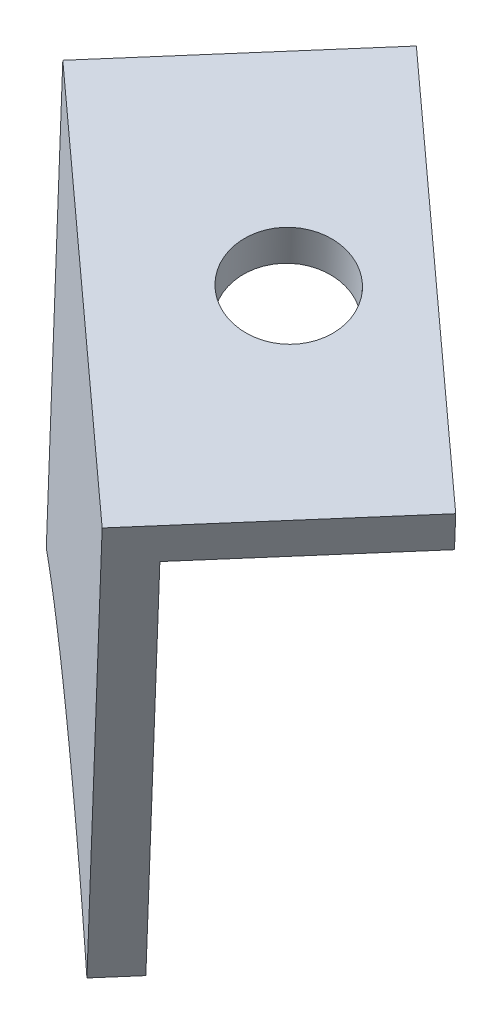
ISO-10303-21;
HEADER;
FILE_DESCRIPTION(('STEP AP214'),'2;1');
FILE_NAME('part.step','',(''),(''),'','','');
FILE_SCHEMA(('AUTOMOTIVE_DESIGN { 1 0 10303 214 1 1 1 1 }'));
ENDSEC;
DATA;
#1=APPLICATION_CONTEXT('core data for automotive mechanical design processes');
#2=APPLICATION_PROTOCOL_DEFINITION('international standard','automotive_design',2000,#1);
#3=PRODUCT_CONTEXT('',#1,'mechanical');
#4=PRODUCT('Part','Part','',(#3));
#5=PRODUCT_RELATED_PRODUCT_CATEGORY('part','',(#4));
#6=PRODUCT_DEFINITION_FORMATION('','',#4);
#7=PRODUCT_DEFINITION_CONTEXT('part definition',#1,'design');
#8=PRODUCT_DEFINITION('design','',#6,#7);
#9=PRODUCT_DEFINITION_SHAPE('','',#8);
#10=(LENGTH_UNIT() NAMED_UNIT(*) SI_UNIT(.MILLI.,.METRE.));
#11=(NAMED_UNIT(*) PLANE_ANGLE_UNIT() SI_UNIT($,.RADIAN.));
#12=(NAMED_UNIT(*) SI_UNIT($,.STERADIAN.) SOLID_ANGLE_UNIT());
#13=UNCERTAINTY_MEASURE_WITH_UNIT(LENGTH_MEASURE(1.E-05),#10,'distance_accuracy_value','');
#14=(GEOMETRIC_REPRESENTATION_CONTEXT(3) GLOBAL_UNCERTAINTY_ASSIGNED_CONTEXT((#13)) GLOBAL_UNIT_ASSIGNED_CONTEXT((#10,
#11,#12)) REPRESENTATION_CONTEXT('',''));
#15=CARTESIAN_POINT('',(0.,0.,0.));
#16=DIRECTION('',(0.,0.,1.));
#17=DIRECTION('',(1.,0.,0.));
#18=AXIS2_PLACEMENT_3D('',#15,#16,#17);
#19=CARTESIAN_POINT('',(795.803473019914,-337.711957076395,317.413502574479));
#20=DIRECTION('',(0.656059028990515,0.,-0.754709580222765));
#21=DIRECTION('',(-0.754709580222765,0.,-0.656059028990515));
#22=AXIS2_PLACEMENT_3D('',#19,#20,#21);
#23=PLANE('',#22);
#24=DIRECTION('',(0.223324238678405,0.955216593660168,0.194132798916043));
#25=VECTOR('',#24,1.);
#26=CARTESIAN_POINT('',(788.39956569233,-337.630660477617,310.97738412659));
#27=LINE('',#26,#25);
#28=CARTESIAN_POINT('',(788.39956569233,-337.630660477617,310.97738412659));
#29=VERTEX_POINT('',#28);
#30=CARTESIAN_POINT('',(794.004014070655,-313.658958520988,315.849256774647));
#31=VERTEX_POINT('',#30);
#32=EDGE_CURVE('E93',#29,#31,#27,.T.);
#33=ORIENTED_EDGE('',*,*,#32,.T.);
#34=DIRECTION('',(-0.720911114423089,0.295907517978624,-0.626678470912309));
#35=VECTOR('',#34,1.);
#36=CARTESIAN_POINT('',(808.422236359117,-319.57710888056,328.382826192893));
#37=LINE('',#36,#35);
#38=CARTESIAN_POINT('',(808.422236359117,-319.57710888056,328.382826192893));
#39=VERTEX_POINT('',#38);
#40=EDGE_CURVE('E124',#39,#31,#37,.T.);
#41=ORIENTED_EDGE('',*,*,#40,.F.);
#42=DIRECTION('',(0.223324238678404,0.955216593660168,0.194132798916043));
#43=VECTOR('',#42,1.);
#44=CARTESIAN_POINT('',(803.285778869515,-341.547090534744,323.917771817822));
#45=LINE('',#44,#43);
#46=CARTESIAN_POINT('',(803.285778869515,-341.547090534744,323.917771817822));
#47=VERTEX_POINT('',#46);
#48=EDGE_CURVE('E80',#47,#39,#45,.T.);
#49=ORIENTED_EDGE('',*,*,#48,.F.);
#50=CARTESIAN_POINT('',(803.285778869516,-341.547090534745,323.917771817823));
#51=CARTESIAN_POINT('',(798.678186592342,-337.74352209005,319.912452958011));
#52=CARTESIAN_POINT('',(793.177264789097,-336.365866812638,315.130574588686));
#53=CARTESIAN_POINT('',(788.399565692324,-337.630660477618,310.977384126584));
#54=(BOUNDED_CURVE() B_SPLINE_CURVE(3,(#50,#51,#52,#53),.UNSPECIFIED.,.F.,
.F.) B_SPLINE_CURVE_WITH_KNOTS((4,4),(0.197302396756267,0.338155289959341),
.UNSPECIFIED.) CURVE() GEOMETRIC_REPRESENTATION_ITEM() RATIONAL_B_SPLINE_CURVE((0.522216299101071,
0.482629046398418,0.495947227092236,0.562170841182523)) REPRESENTATION_ITEM(''));
#55=EDGE_CURVE('E78',#47,#29,#54,.T.);
#56=ORIENTED_EDGE('',*,*,#55,.T.);
#57=EDGE_LOOP('',(#33,#41,#49,#56));
#58=FACE_BOUND('',#57,.T.);
#59=ADVANCED_FACE('F36',(#58),#23,.T.);
#60=DIRECTION('',(-0.656059028990508,0.,0.754709580222771));
#61=VECTOR('',#60,1.);
#62=SURFACE_OF_LINEAR_EXTRUSION('',#54,#61);
#63=CARTESIAN_POINT('',(801.973660811535,-341.547090534745,325.427190978269));
#64=CARTESIAN_POINT('',(797.366068534361,-337.74352209005,321.421872118456));
#65=CARTESIAN_POINT('',(791.865146731115,-336.365866812638,316.639993749131));
#66=CARTESIAN_POINT('',(787.087447634343,-337.630660477618,312.48680328703));
#67=(BOUNDED_CURVE() B_SPLINE_CURVE(3,(#63,#64,#65,#66),.UNSPECIFIED.,.F.,
.F.) B_SPLINE_CURVE_WITH_KNOTS((4,4),(0.197302396756267,0.338155289959341),
.UNSPECIFIED.) CURVE() GEOMETRIC_REPRESENTATION_ITEM() RATIONAL_B_SPLINE_CURVE((0.522216299101071,
0.482629046398418,0.495947227092236,0.562170841182523)) REPRESENTATION_ITEM(''));
#68=CARTESIAN_POINT('',(801.973660811534,-341.547090534744,325.427190978268));
#69=VERTEX_POINT('',#68);
#70=CARTESIAN_POINT('',(787.087447634349,-337.630660477617,312.486803287035));
#71=VERTEX_POINT('',#70);
#72=EDGE_CURVE('E76',#69,#71,#67,.T.);
#73=ORIENTED_EDGE('',*,*,#72,.T.);
#74=DIRECTION('',(-0.656059028990508,0.,0.754709580222771));
#75=VECTOR('',#74,1.);
#76=CARTESIAN_POINT('',(788.39956569233,-337.630660477617,310.97738412659));
#77=LINE('',#76,#75);
#78=EDGE_CURVE('E11',#29,#71,#77,.T.);
#79=ORIENTED_EDGE('',*,*,#78,.F.);
#80=ORIENTED_EDGE('',*,*,#55,.F.);
#81=DIRECTION('',(-0.656059028990508,0.,0.754709580222771));
#82=VECTOR('',#81,1.);
#83=CARTESIAN_POINT('',(803.285778869515,-341.547090534744,323.917771817822));
#84=LINE('',#83,#82);
#85=EDGE_CURVE('E54',#47,#69,#84,.T.);
#86=ORIENTED_EDGE('',*,*,#85,.T.);
#87=EDGE_LOOP('',(#73,#79,#80,#86));
#88=FACE_BOUND('',#87,.T.);
#89=ADVANCED_FACE('F38',(#88),#62,.F.);
#90=CARTESIAN_POINT('',(788.39956569233,-337.630660477617,310.97738412659));
#91=DIRECTION('',(0.72091111442309,-0.295907517978618,0.626678470912311));
#92=DIRECTION('',(0.656059028990508,0.,-0.754709580222771));
#93=AXIS2_PLACEMENT_3D('',#90,#91,#92);
#94=PLANE('',#93);
#95=DIRECTION('',(0.223324238678405,0.955216593660168,0.194132798916043));
#96=VECTOR('',#95,1.);
#97=CARTESIAN_POINT('',(787.087447634349,-337.630660477617,312.486803287035));
#98=LINE('',#97,#96);
#99=CARTESIAN_POINT('',(793.138544490033,-311.748525333667,317.746941532923));
#100=VERTEX_POINT('',#99);
#101=EDGE_CURVE('E87',#71,#100,#98,.T.);
#102=ORIENTED_EDGE('',*,*,#101,.T.);
#103=DIRECTION('',(-0.656059028990508,0.,0.754709580222771));
#104=VECTOR('',#103,1.);
#105=CARTESIAN_POINT('',(794.450662548014,-311.748525333667,316.237522372477));
#106=LINE('',#105,#104);
#107=CARTESIAN_POINT('',(801.011252837917,-311.748525333667,308.690426570252));
#108=VERTEX_POINT('',#107);
#109=EDGE_CURVE('E46',#108,#100,#106,.T.);
#110=ORIENTED_EDGE('',*,*,#109,.F.);
#111=DIRECTION('',(-0.223324238678425,-0.955216593660159,-0.194132798916061));
#112=VECTOR('',#111,1.);
#113=CARTESIAN_POINT('',(801.011252837917,-311.748525333667,308.690426570252));
#114=LINE('',#113,#112);
#115=CARTESIAN_POINT('',(800.56460436056,-313.658958520988,308.302160972419));
#116=VERTEX_POINT('',#115);
#117=EDGE_CURVE('E111',#108,#116,#114,.T.);
#118=ORIENTED_EDGE('',*,*,#117,.T.);
#119=DIRECTION('',(-0.656059028990508,0.,0.754709580222771));
#120=VECTOR('',#119,1.);
#121=CARTESIAN_POINT('',(800.56460436056,-313.658958520988,308.302160972419));
#122=LINE('',#121,#120);
#123=EDGE_CURVE('E88',#116,#31,#122,.T.);
#124=ORIENTED_EDGE('',*,*,#123,.T.);
#125=ORIENTED_EDGE('',*,*,#32,.F.);
#126=ORIENTED_EDGE('',*,*,#78,.T.);
#127=EDGE_LOOP('',(#102,#110,#118,#124,#125,#126));
#128=FACE_BOUND('',#127,.T.);
#129=ADVANCED_FACE('F108',(#128),#94,.F.);
#130=CARTESIAN_POINT('',(794.450662548014,-311.748525333667,316.237522372477));
#131=DIRECTION('',(-0.223324238678409,-0.955216593660166,-0.194132798916047));
#132=DIRECTION('',(0.97374178000948,-0.227655322503056,0.));
#133=AXIS2_PLACEMENT_3D('',#130,#131,#132);
#134=PLANE('',#133);
#135=CARTESIAN_POINT('',(804.940068837195,-314.707600513454,318.730759180489));
#136=DIRECTION('',(-0.223324238678409,-0.955216593660166,-0.194132798916047));
#137=DIRECTION('',(0.97374178000948,-0.227655322503056,0.));
#138=AXIS2_PLACEMENT_3D('',#135,#136,#137);
#139=CIRCLE('',#138,2.49999999999996);
#140=CARTESIAN_POINT('',(807.374423287219,-315.276738819711,318.730759180489));
#141=VERTEX_POINT('',#140);
#142=EDGE_CURVE('E132',#141,#141,#139,.T.);
#143=ORIENTED_EDGE('',*,*,#142,.T.);
#144=EDGE_LOOP('',(#143));
#145=FACE_BOUND('',#144,.T.);
#146=DIRECTION('',(0.720911114423091,-0.295907517978623,0.626678470912308));
#147=VECTOR('',#146,1.);
#148=CARTESIAN_POINT('',(793.138544490033,-311.748525333667,317.746941532923));
#149=LINE('',#148,#147);
#150=CARTESIAN_POINT('',(807.556766778495,-317.66667569324,330.280510951169));
#151=VERTEX_POINT('',#150);
#152=EDGE_CURVE('E91',#100,#151,#149,.T.);
#153=ORIENTED_EDGE('',*,*,#152,.T.);
#154=DIRECTION('',(-0.656059028990508,0.,0.754709580222771));
#155=VECTOR('',#154,1.);
#156=CARTESIAN_POINT('',(808.868884836476,-317.66667569324,328.771091790723));
#157=LINE('',#156,#155);
#158=CARTESIAN_POINT('',(815.429475126379,-317.66667569324,321.223995988498));
#159=VERTEX_POINT('',#158);
#160=EDGE_CURVE('E70',#159,#151,#157,.T.);
#161=ORIENTED_EDGE('',*,*,#160,.F.);
#162=DIRECTION('',(-0.720911114423088,0.295907517978624,-0.62667847091231));
#163=VECTOR('',#162,1.);
#164=CARTESIAN_POINT('',(815.429475126379,-317.66667569324,321.223995988498));
#165=LINE('',#164,#163);
#166=EDGE_CURVE('E104',#159,#108,#165,.T.);
#167=ORIENTED_EDGE('',*,*,#166,.T.);
#168=ORIENTED_EDGE('',*,*,#109,.T.);
#169=EDGE_LOOP('',(#153,#161,#167,#168));
#170=FACE_BOUND('',#169,.T.);
#171=ADVANCED_FACE('F101',(#145,#170),#134,.F.);
#172=CARTESIAN_POINT('',(803.285778869515,-341.547090534744,323.917771817822));
#173=DIRECTION('',(0.720911114423091,-0.295907517978617,0.626678470912311));
#174=DIRECTION('',(0.656059028990508,0.,-0.754709580222771));
#175=AXIS2_PLACEMENT_3D('',#172,#173,#174);
#176=PLANE('',#175);
#177=DIRECTION('',(0.223324238678404,0.955216593660168,0.194132798916043));
#178=VECTOR('',#177,1.);
#179=CARTESIAN_POINT('',(801.973660811534,-341.547090534744,325.427190978268));
#180=LINE('',#179,#178);
#181=EDGE_CURVE('E86',#69,#151,#180,.T.);
#182=ORIENTED_EDGE('',*,*,#181,.F.);
#183=ORIENTED_EDGE('',*,*,#85,.F.);
#184=ORIENTED_EDGE('',*,*,#48,.T.);
#185=DIRECTION('',(-0.656059028990508,0.,0.754709580222771));
#186=VECTOR('',#185,1.);
#187=CARTESIAN_POINT('',(814.982826649022,-319.57710888056,320.835730390666));
#188=LINE('',#187,#186);
#189=CARTESIAN_POINT('',(814.982826649022,-319.57710888056,320.835730390666));
#190=VERTEX_POINT('',#189);
#191=EDGE_CURVE('E129',#190,#39,#188,.T.);
#192=ORIENTED_EDGE('',*,*,#191,.F.);
#193=DIRECTION('',(0.223324238678425,0.955216593660159,0.194132798916061));
#194=VECTOR('',#193,1.);
#195=CARTESIAN_POINT('',(814.982826649022,-319.57710888056,320.835730390666));
#196=LINE('',#195,#194);
#197=EDGE_CURVE('E122',#190,#159,#196,.T.);
#198=ORIENTED_EDGE('',*,*,#197,.T.);
#199=ORIENTED_EDGE('',*,*,#160,.T.);
#200=EDGE_LOOP('',(#182,#183,#184,#192,#198,#199));
#201=FACE_BOUND('',#200,.T.);
#202=ADVANCED_FACE('F90',(#201),#176,.T.);
#203=CARTESIAN_POINT('',(794.491354961933,-337.711957076395,318.922921734924));
#204=DIRECTION('',(0.656059028990515,0.,-0.754709580222765));
#205=DIRECTION('',(-0.754709580222765,0.,-0.656059028990515));
#206=AXIS2_PLACEMENT_3D('',#203,#204,#205);
#207=PLANE('',#206);
#208=ORIENTED_EDGE('',*,*,#72,.F.);
#209=ORIENTED_EDGE('',*,*,#181,.T.);
#210=ORIENTED_EDGE('',*,*,#152,.F.);
#211=ORIENTED_EDGE('',*,*,#101,.F.);
#212=EDGE_LOOP('',(#208,#209,#210,#211));
#213=FACE_BOUND('',#212,.T.);
#214=ADVANCED_FACE('F84',(#213),#207,.F.);
#215=CARTESIAN_POINT('',(814.982826649022,-319.57710888056,320.835730390666));
#216=DIRECTION('',(0.223324238678409,0.955216593660166,0.194132798916048));
#217=DIRECTION('',(-0.973741780009479,0.227655322503057,0.));
#218=AXIS2_PLACEMENT_3D('',#215,#216,#217);
#219=PLANE('',#218);
#220=CARTESIAN_POINT('',(804.493420359838,-316.618033700774,318.342493582657));
#221=DIRECTION('',(-0.22332423867841,-0.955216593660166,-0.194132798916048));
#222=DIRECTION('',(0.973741780009479,-0.227655322503057,0.));
#223=AXIS2_PLACEMENT_3D('',#220,#221,#222);
#224=CIRCLE('',#223,2.49999999999996);
#225=CARTESIAN_POINT('',(806.927774809862,-317.187172007032,318.342493582657));
#226=VERTEX_POINT('',#225);
#227=EDGE_CURVE('E232',#226,#226,#224,.T.);
#228=ORIENTED_EDGE('',*,*,#227,.F.);
#229=EDGE_LOOP('',(#228));
#230=FACE_BOUND('',#229,.T.);
#231=ORIENTED_EDGE('',*,*,#40,.T.);
#232=ORIENTED_EDGE('',*,*,#123,.F.);
#233=DIRECTION('',(-0.720911114423089,0.295907517978624,-0.626678470912309));
#234=VECTOR('',#233,1.);
#235=CARTESIAN_POINT('',(814.982826649022,-319.57710888056,320.835730390666));
#236=LINE('',#235,#234);
#237=EDGE_CURVE('E119',#190,#116,#236,.T.);
#238=ORIENTED_EDGE('',*,*,#237,.F.);
#239=ORIENTED_EDGE('',*,*,#191,.T.);
#240=EDGE_LOOP('',(#231,#232,#238,#239));
#241=FACE_BOUND('',#240,.T.);
#242=ADVANCED_FACE('F155',(#230,#241),#219,.F.);
#243=CARTESIAN_POINT('',(191.922880158914,8.3059509659947E-12,-220.782017957674));
#244=DIRECTION('',(-0.656059028990508,0.,0.754709580222771));
#245=DIRECTION('',(0.754709580222771,0.,0.656059028990508));
#246=AXIS2_PLACEMENT_3D('',#243,#244,#245);
#247=PLANE('',#246);
#248=ORIENTED_EDGE('',*,*,#237,.T.);
#249=ORIENTED_EDGE('',*,*,#117,.F.);
#250=ORIENTED_EDGE('',*,*,#166,.F.);
#251=ORIENTED_EDGE('',*,*,#197,.F.);
#252=EDGE_LOOP('',(#248,#249,#250,#251));
#253=FACE_BOUND('',#252,.T.);
#254=ADVANCED_FACE('F116',(#253),#247,.F.);
#255=CARTESIAN_POINT('',(805.833365791909,-310.886734138813,319.507290376153));
#256=DIRECTION('',(-0.223324238678409,-0.955216593660166,-0.194132798916048));
#257=DIRECTION('',(0.973741780009479,-0.227655322503057,0.));
#258=AXIS2_PLACEMENT_3D('',#255,#256,#257);
#259=CYLINDRICAL_SURFACE('',#258,2.49999999999996);
#260=ORIENTED_EDGE('',*,*,#227,.T.);
#261=EDGE_LOOP('',(#260));
#262=FACE_BOUND('',#261,.T.);
#263=ORIENTED_EDGE('',*,*,#142,.F.);
#264=EDGE_LOOP('',(#263));
#265=FACE_BOUND('',#264,.T.);
#266=ADVANCED_FACE('F167',(#262,#265),#259,.F.);
#267=CLOSED_SHELL('',(#59,#89,#129,#171,#202,#214,#242,#254,#266));
#268=MANIFOLD_SOLID_BREP('B2',#267);
#269=ADVANCED_BREP_SHAPE_REPRESENTATION('',(#18,#268),#14);
#270=SHAPE_DEFINITION_REPRESENTATION(#9,#269);
ENDSEC;
END-ISO-10303-21;
